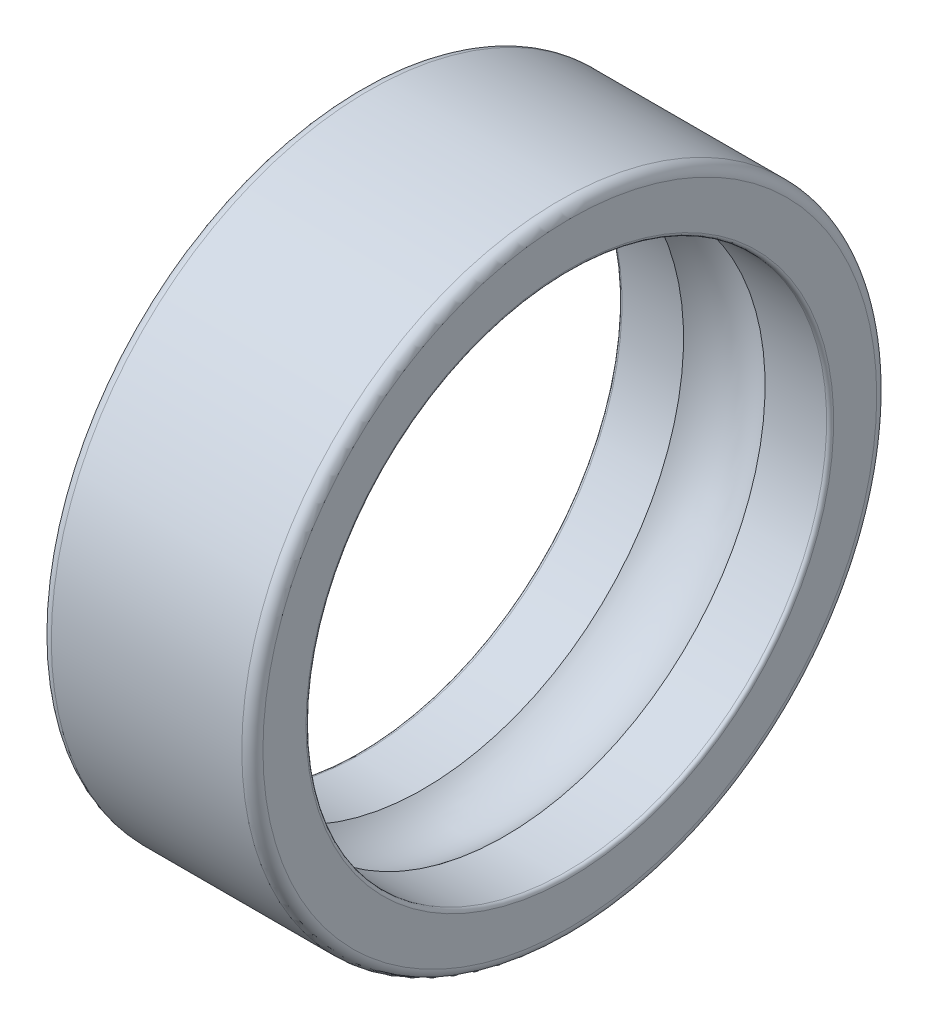
ISO-10303-21;
HEADER;
FILE_DESCRIPTION(('STEP AP214'),'2;1');
FILE_NAME('part.step','',(''),(''),'','','');
FILE_SCHEMA(('AUTOMOTIVE_DESIGN { 1 0 10303 214 1 1 1 1 }'));
ENDSEC;
DATA;
#1=APPLICATION_CONTEXT('core data for automotive mechanical design processes');
#2=APPLICATION_PROTOCOL_DEFINITION('international standard','automotive_design',2000,#1);
#3=PRODUCT_CONTEXT('',#1,'mechanical');
#4=PRODUCT('Part','Part','',(#3));
#5=PRODUCT_RELATED_PRODUCT_CATEGORY('part','',(#4));
#6=PRODUCT_DEFINITION_FORMATION('','',#4);
#7=PRODUCT_DEFINITION_CONTEXT('part definition',#1,'design');
#8=PRODUCT_DEFINITION('design','',#6,#7);
#9=PRODUCT_DEFINITION_SHAPE('','',#8);
#10=(LENGTH_UNIT() NAMED_UNIT(*) SI_UNIT(.MILLI.,.METRE.));
#11=(NAMED_UNIT(*) PLANE_ANGLE_UNIT() SI_UNIT($,.RADIAN.));
#12=(NAMED_UNIT(*) SI_UNIT($,.STERADIAN.) SOLID_ANGLE_UNIT());
#13=UNCERTAINTY_MEASURE_WITH_UNIT(LENGTH_MEASURE(1.E-05),#10,'distance_accuracy_value','');
#14=(GEOMETRIC_REPRESENTATION_CONTEXT(3) GLOBAL_UNCERTAINTY_ASSIGNED_CONTEXT((#13)) GLOBAL_UNIT_ASSIGNED_CONTEXT((#10,
#11,#12)) REPRESENTATION_CONTEXT('',''));
#15=CARTESIAN_POINT('',(0.,0.,0.));
#16=DIRECTION('',(0.,0.,1.));
#17=DIRECTION('',(1.,0.,0.));
#18=AXIS2_PLACEMENT_3D('',#15,#16,#17);
#19=CARTESIAN_POINT('',(0.0166666666666823,0.,0.));
#20=DIRECTION('',(-1.,0.,0.));
#21=DIRECTION('',(0.,0.,1.));
#22=AXIS2_PLACEMENT_3D('',#19,#20,#21);
#23=TOROIDAL_SURFACE('',#22,1.24666666666668,0.0166666666666824);
#24=CARTESIAN_POINT('',(0.016666666666667,0.,0.));
#25=DIRECTION('',(-1.,0.,0.));
#26=DIRECTION('',(0.,0.,1.));
#27=AXIS2_PLACEMENT_3D('',#24,#25,#26);
#28=CIRCLE('',#27,1.23);
#29=CARTESIAN_POINT('',(0.016666666666667,0.,1.23));
#30=VERTEX_POINT('',#29);
#31=EDGE_CURVE('E10',#30,#30,#28,.T.);
#32=ORIENTED_EDGE('',*,*,#31,.F.);
#33=EDGE_LOOP('',(#32));
#34=FACE_BOUND('',#33,.T.);
#35=CARTESIAN_POINT('',(0.,0.,0.));
#36=DIRECTION('',(-1.,0.,0.));
#37=DIRECTION('',(0.,0.,1.));
#38=AXIS2_PLACEMENT_3D('',#35,#36,#37);
#39=CIRCLE('',#38,1.2466666666667);
#40=CARTESIAN_POINT('',(0.,0.,1.2466666666667));
#41=VERTEX_POINT('',#40);
#42=EDGE_CURVE('E65',#41,#41,#39,.T.);
#43=ORIENTED_EDGE('',*,*,#42,.T.);
#44=EDGE_LOOP('',(#43));
#45=FACE_BOUND('',#44,.T.);
#46=ADVANCED_FACE('F31',(#34,#45),#23,.T.);
#47=CARTESIAN_POINT('',(1.,0.,0.));
#48=DIRECTION('',(-1.,0.,0.));
#49=DIRECTION('',(0.,0.,1.));
#50=AXIS2_PLACEMENT_3D('',#47,#48,#49);
#51=CYLINDRICAL_SURFACE('',#50,1.23);
#52=CARTESIAN_POINT('',(0.30738639715742,0.,0.));
#53=DIRECTION('',(-1.,0.,0.));
#54=DIRECTION('',(0.,0.,1.));
#55=AXIS2_PLACEMENT_3D('',#52,#53,#54);
#56=CIRCLE('',#55,1.23);
#57=CARTESIAN_POINT('',(0.30738639715742,0.,1.23));
#58=VERTEX_POINT('',#57);
#59=EDGE_CURVE('E37',#58,#58,#56,.T.);
#60=ORIENTED_EDGE('',*,*,#59,.F.);
#61=EDGE_LOOP('',(#60));
#62=FACE_BOUND('',#61,.T.);
#63=ORIENTED_EDGE('',*,*,#31,.T.);
#64=EDGE_LOOP('',(#63));
#65=FACE_BOUND('',#64,.T.);
#66=ADVANCED_FACE('F114',(#62,#65),#51,.F.);
#67=CARTESIAN_POINT('',(0.5,0.,0.));
#68=DIRECTION('',(-1.,0.,0.));
#69=DIRECTION('',(0.,0.,1.));
#70=AXIS2_PLACEMENT_3D('',#67,#68,#69);
#71=TOROIDAL_SURFACE('',#70,1.00000000000001,0.299999999999994);
#72=CARTESIAN_POINT('',(0.69261360284258,0.,0.));
#73=DIRECTION('',(-1.,0.,0.));
#74=DIRECTION('',(0.,0.,1.));
#75=AXIS2_PLACEMENT_3D('',#72,#73,#74);
#76=CIRCLE('',#75,1.23);
#77=CARTESIAN_POINT('',(0.69261360284258,0.,1.23));
#78=VERTEX_POINT('',#77);
#79=EDGE_CURVE('E41',#78,#78,#76,.T.);
#80=ORIENTED_EDGE('',*,*,#79,.F.);
#81=EDGE_LOOP('',(#80));
#82=FACE_BOUND('',#81,.T.);
#83=ORIENTED_EDGE('',*,*,#59,.T.);
#84=EDGE_LOOP('',(#83));
#85=FACE_BOUND('',#84,.T.);
#86=ADVANCED_FACE('F109',(#82,#85),#71,.F.);
#87=CARTESIAN_POINT('',(1.,0.,0.));
#88=DIRECTION('',(-1.,0.,0.));
#89=DIRECTION('',(0.,0.,1.));
#90=AXIS2_PLACEMENT_3D('',#87,#88,#89);
#91=CYLINDRICAL_SURFACE('',#90,1.23);
#92=CARTESIAN_POINT('',(0.98333333333333,0.,0.));
#93=DIRECTION('',(-1.,0.,0.));
#94=DIRECTION('',(0.,0.,1.));
#95=AXIS2_PLACEMENT_3D('',#92,#93,#94);
#96=CIRCLE('',#95,1.23);
#97=CARTESIAN_POINT('',(0.98333333333333,0.,1.23));
#98=VERTEX_POINT('',#97);
#99=EDGE_CURVE('E45',#98,#98,#96,.T.);
#100=ORIENTED_EDGE('',*,*,#99,.F.);
#101=EDGE_LOOP('',(#100));
#102=FACE_BOUND('',#101,.T.);
#103=ORIENTED_EDGE('',*,*,#79,.T.);
#104=EDGE_LOOP('',(#103));
#105=FACE_BOUND('',#104,.T.);
#106=ADVANCED_FACE('F103',(#102,#105),#91,.F.);
#107=CARTESIAN_POINT('',(0.983333333333319,0.,0.));
#108=DIRECTION('',(-1.,0.,0.));
#109=DIRECTION('',(0.,0.,1.));
#110=AXIS2_PLACEMENT_3D('',#107,#108,#109);
#111=TOROIDAL_SURFACE('',#110,1.24666666666668,0.0166666666666809);
#112=CARTESIAN_POINT('',(1.,0.,0.));
#113=DIRECTION('',(-1.,0.,0.));
#114=DIRECTION('',(0.,0.,1.));
#115=AXIS2_PLACEMENT_3D('',#112,#113,#114);
#116=CIRCLE('',#115,1.2466666666667);
#117=CARTESIAN_POINT('',(1.,0.,1.2466666666667));
#118=VERTEX_POINT('',#117);
#119=EDGE_CURVE('E50',#118,#118,#116,.T.);
#120=ORIENTED_EDGE('',*,*,#119,.F.);
#121=EDGE_LOOP('',(#120));
#122=FACE_BOUND('',#121,.T.);
#123=ORIENTED_EDGE('',*,*,#99,.T.);
#124=EDGE_LOOP('',(#123));
#125=FACE_BOUND('',#124,.T.);
#126=ADVANCED_FACE('F97',(#122,#125),#111,.T.);
#127=CARTESIAN_POINT('',(1.,1.2466666666667,0.));
#128=DIRECTION('',(-1.,0.,0.));
#129=DIRECTION('',(0.,0.,1.));
#130=AXIS2_PLACEMENT_3D('',#127,#128,#129);
#131=PLANE('',#130);
#132=CARTESIAN_POINT('',(1.,0.,0.));
#133=DIRECTION('',(-1.,0.,0.));
#134=DIRECTION('',(0.,0.,1.));
#135=AXIS2_PLACEMENT_3D('',#132,#133,#134);
#136=CIRCLE('',#135,1.45);
#137=CARTESIAN_POINT('',(1.,0.,1.45));
#138=VERTEX_POINT('',#137);
#139=EDGE_CURVE('E53',#138,#138,#136,.T.);
#140=ORIENTED_EDGE('',*,*,#139,.F.);
#141=EDGE_LOOP('',(#140));
#142=FACE_BOUND('',#141,.T.);
#143=ORIENTED_EDGE('',*,*,#119,.T.);
#144=EDGE_LOOP('',(#143));
#145=FACE_BOUND('',#144,.T.);
#146=ADVANCED_FACE('F91',(#142,#145),#131,.F.);
#147=CARTESIAN_POINT('',(0.949999999999958,0.,0.));
#148=DIRECTION('',(-1.,0.,0.));
#149=DIRECTION('',(0.,0.,1.));
#150=AXIS2_PLACEMENT_3D('',#147,#148,#149);
#151=TOROIDAL_SURFACE('',#150,1.44999999999996,0.0500000000000425);
#152=CARTESIAN_POINT('',(0.95,0.,0.));
#153=DIRECTION('',(-1.,0.,0.));
#154=DIRECTION('',(0.,0.,1.));
#155=AXIS2_PLACEMENT_3D('',#152,#153,#154);
#156=CIRCLE('',#155,1.5);
#157=CARTESIAN_POINT('',(0.95,0.,1.5));
#158=VERTEX_POINT('',#157);
#159=EDGE_CURVE('E56',#158,#158,#156,.T.);
#160=ORIENTED_EDGE('',*,*,#159,.F.);
#161=EDGE_LOOP('',(#160));
#162=FACE_BOUND('',#161,.T.);
#163=ORIENTED_EDGE('',*,*,#139,.T.);
#164=EDGE_LOOP('',(#163));
#165=FACE_BOUND('',#164,.T.);
#166=ADVANCED_FACE('F85',(#162,#165),#151,.T.);
#167=CARTESIAN_POINT('',(1.,0.,0.));
#168=DIRECTION('',(-1.,0.,0.));
#169=DIRECTION('',(0.,0.,1.));
#170=AXIS2_PLACEMENT_3D('',#167,#168,#169);
#171=CYLINDRICAL_SURFACE('',#170,1.5);
#172=CARTESIAN_POINT('',(0.05,0.,0.));
#173=DIRECTION('',(-1.,0.,0.));
#174=DIRECTION('',(0.,0.,1.));
#175=AXIS2_PLACEMENT_3D('',#172,#173,#174);
#176=CIRCLE('',#175,1.5);
#177=CARTESIAN_POINT('',(0.05,0.,1.5));
#178=VERTEX_POINT('',#177);
#179=EDGE_CURVE('E59',#178,#178,#176,.T.);
#180=ORIENTED_EDGE('',*,*,#179,.F.);
#181=EDGE_LOOP('',(#180));
#182=FACE_BOUND('',#181,.T.);
#183=ORIENTED_EDGE('',*,*,#159,.T.);
#184=EDGE_LOOP('',(#183));
#185=FACE_BOUND('',#184,.T.);
#186=ADVANCED_FACE('F79',(#182,#185),#171,.T.);
#187=CARTESIAN_POINT('',(0.0500000000000474,0.,0.));
#188=DIRECTION('',(-1.,0.,0.));
#189=DIRECTION('',(0.,0.,1.));
#190=AXIS2_PLACEMENT_3D('',#187,#188,#189);
#191=TOROIDAL_SURFACE('',#190,1.44999999999995,0.0500000000000474);
#192=CARTESIAN_POINT('',(0.,0.,0.));
#193=DIRECTION('',(-1.,0.,0.));
#194=DIRECTION('',(0.,0.,1.));
#195=AXIS2_PLACEMENT_3D('',#192,#193,#194);
#196=CIRCLE('',#195,1.45);
#197=CARTESIAN_POINT('',(0.,0.,1.45));
#198=VERTEX_POINT('',#197);
#199=EDGE_CURVE('E62',#198,#198,#196,.T.);
#200=ORIENTED_EDGE('',*,*,#199,.F.);
#201=EDGE_LOOP('',(#200));
#202=FACE_BOUND('',#201,.T.);
#203=ORIENTED_EDGE('',*,*,#179,.T.);
#204=EDGE_LOOP('',(#203));
#205=FACE_BOUND('',#204,.T.);
#206=ADVANCED_FACE('F73',(#202,#205),#191,.T.);
#207=CARTESIAN_POINT('',(0.,1.45,0.));
#208=DIRECTION('',(1.,0.,0.));
#209=DIRECTION('',(0.,0.,-1.));
#210=AXIS2_PLACEMENT_3D('',#207,#208,#209);
#211=PLANE('',#210);
#212=ORIENTED_EDGE('',*,*,#42,.F.);
#213=EDGE_LOOP('',(#212));
#214=FACE_BOUND('',#213,.T.);
#215=ORIENTED_EDGE('',*,*,#199,.T.);
#216=EDGE_LOOP('',(#215));
#217=FACE_BOUND('',#216,.T.);
#218=ADVANCED_FACE('F70',(#214,#217),#211,.F.);
#219=CLOSED_SHELL('',(#46,#66,#86,#106,#126,#146,#166,#186,#206,#218));
#220=MANIFOLD_SOLID_BREP('B2',#219);
#221=ADVANCED_BREP_SHAPE_REPRESENTATION('',(#18,#220),#14);
#222=SHAPE_DEFINITION_REPRESENTATION(#9,#221);
ENDSEC;
END-ISO-10303-21;
